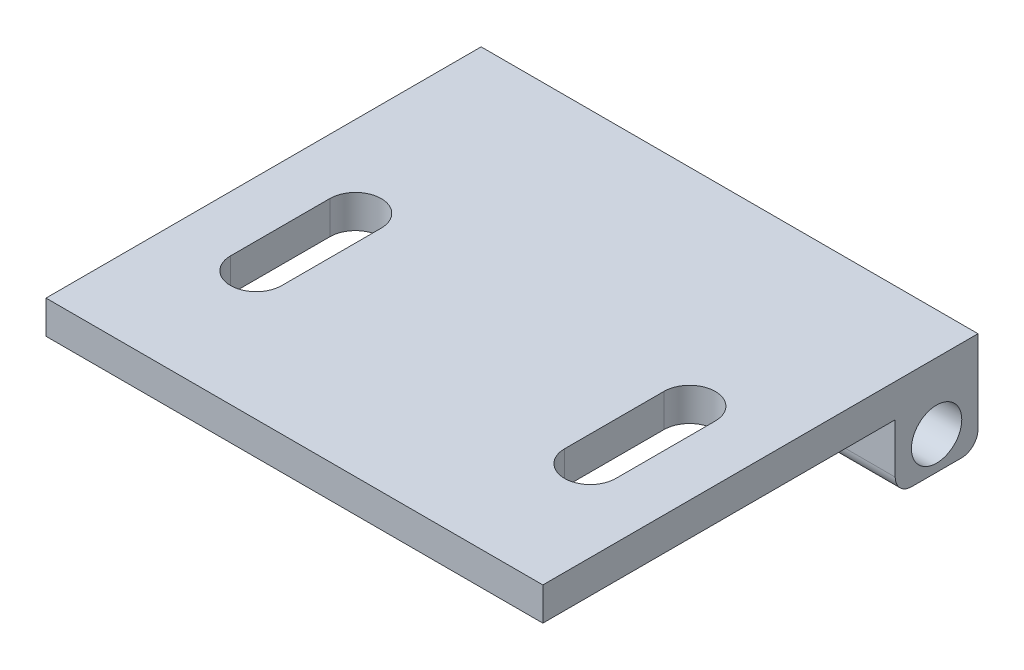
ISO-10303-21;
HEADER;
FILE_DESCRIPTION(('STEP AP214'),'2;1');
FILE_NAME('part.step','',(''),(''),'','','');
FILE_SCHEMA(('AUTOMOTIVE_DESIGN { 1 0 10303 214 1 1 1 1 }'));
ENDSEC;
DATA;
#1=APPLICATION_CONTEXT('core data for automotive mechanical design processes');
#2=APPLICATION_PROTOCOL_DEFINITION('international standard','automotive_design',2000,#1);
#3=PRODUCT_CONTEXT('',#1,'mechanical');
#4=PRODUCT('Part','Part','',(#3));
#5=PRODUCT_RELATED_PRODUCT_CATEGORY('part','',(#4));
#6=PRODUCT_DEFINITION_FORMATION('','',#4);
#7=PRODUCT_DEFINITION_CONTEXT('part definition',#1,'design');
#8=PRODUCT_DEFINITION('design','',#6,#7);
#9=PRODUCT_DEFINITION_SHAPE('','',#8);
#10=(LENGTH_UNIT() NAMED_UNIT(*) SI_UNIT(.MILLI.,.METRE.));
#11=(NAMED_UNIT(*) PLANE_ANGLE_UNIT() SI_UNIT($,.RADIAN.));
#12=(NAMED_UNIT(*) SI_UNIT($,.STERADIAN.) SOLID_ANGLE_UNIT());
#13=UNCERTAINTY_MEASURE_WITH_UNIT(LENGTH_MEASURE(1.E-05),#10,'distance_accuracy_value','');
#14=(GEOMETRIC_REPRESENTATION_CONTEXT(3) GLOBAL_UNCERTAINTY_ASSIGNED_CONTEXT((#13)) GLOBAL_UNIT_ASSIGNED_CONTEXT((#10,
#11,#12)) REPRESENTATION_CONTEXT('',''));
#15=CARTESIAN_POINT('',(0.,0.,0.));
#16=DIRECTION('',(0.,0.,1.));
#17=DIRECTION('',(1.,0.,0.));
#18=AXIS2_PLACEMENT_3D('',#15,#16,#17);
#19=CARTESIAN_POINT('',(30.,1.11113094634996,-10.7178759968555));
#20=DIRECTION('',(1.,0.,0.));
#21=DIRECTION('',(0.,0.,-1.));
#22=AXIS2_PLACEMENT_3D('',#19,#20,#21);
#23=PLANE('',#22);
#24=DIRECTION('',(0.,0.,1.));
#25=VECTOR('',#24,1.);
#26=CARTESIAN_POINT('',(30.,6.11113094634996,-14.2178759968555));
#27=LINE('',#26,#25);
#28=CARTESIAN_POINT('',(30.,6.11113094634996,-14.7178759968555));
#29=VERTEX_POINT('',#28);
#30=CARTESIAN_POINT('',(30.,6.11113094634996,11.5556113086594));
#31=VERTEX_POINT('',#30);
#32=EDGE_CURVE('E221',#29,#31,#27,.T.);
#33=ORIENTED_EDGE('',*,*,#32,.T.);
#34=DIRECTION('',(0.,-1.,0.));
#35=VECTOR('',#34,1.);
#36=CARTESIAN_POINT('',(30.,6.11113094634996,11.5556113086594));
#37=LINE('',#36,#35);
#38=CARTESIAN_POINT('',(30.,4.11113094634996,11.5556113086594));
#39=VERTEX_POINT('',#38);
#40=EDGE_CURVE('E224',#31,#39,#37,.T.);
#41=ORIENTED_EDGE('',*,*,#40,.T.);
#42=DIRECTION('',(0.,0.,-1.));
#43=VECTOR('',#42,1.);
#44=CARTESIAN_POINT('',(30.,4.11113094634996,11.5556113086594));
#45=LINE('',#44,#43);
#46=CARTESIAN_POINT('',(30.,4.11113094634996,-9.71787599685553));
#47=VERTEX_POINT('',#46);
#48=EDGE_CURVE('E227',#39,#47,#45,.T.);
#49=ORIENTED_EDGE('',*,*,#48,.T.);
#50=DIRECTION('',(0.,-1.,0.));
#51=VECTOR('',#50,1.);
#52=CARTESIAN_POINT('',(30.,4.11113094634996,-9.71787599685553));
#53=LINE('',#52,#51);
#54=CARTESIAN_POINT('',(30.,1.11113094634997,-9.71787599685553));
#55=VERTEX_POINT('',#54);
#56=EDGE_CURVE('E229',#47,#55,#53,.T.);
#57=ORIENTED_EDGE('',*,*,#56,.T.);
#58=CARTESIAN_POINT('',(30.,1.11113094634996,-10.7178759968555));
#59=DIRECTION('',(1.,0.,0.));
#60=DIRECTION('',(0.,0.,-1.));
#61=AXIS2_PLACEMENT_3D('',#58,#59,#60);
#62=CIRCLE('',#61,1.);
#63=CARTESIAN_POINT('',(30.,0.111130946349961,-10.7178759968555));
#64=VERTEX_POINT('',#63);
#65=EDGE_CURVE('E231',#55,#64,#62,.T.);
#66=ORIENTED_EDGE('',*,*,#65,.T.);
#67=DIRECTION('',(0.,0.,-1.));
#68=VECTOR('',#67,1.);
#69=CARTESIAN_POINT('',(30.,0.111130946349961,-13.7178759968555));
#70=LINE('',#69,#68);
#71=CARTESIAN_POINT('',(30.,0.111130946349961,-13.7178759968555));
#72=VERTEX_POINT('',#71);
#73=EDGE_CURVE('E233',#64,#72,#70,.T.);
#74=ORIENTED_EDGE('',*,*,#73,.T.);
#75=CARTESIAN_POINT('',(30.,1.11113094634996,-13.7178759968555));
#76=DIRECTION('',(1.,0.,0.));
#77=DIRECTION('',(0.,0.,1.));
#78=AXIS2_PLACEMENT_3D('',#75,#76,#77);
#79=CIRCLE('',#78,1.);
#80=CARTESIAN_POINT('',(30.,1.11113094634997,-14.7178759968555));
#81=VERTEX_POINT('',#80);
#82=EDGE_CURVE('E235',#72,#81,#79,.T.);
#83=ORIENTED_EDGE('',*,*,#82,.T.);
#84=DIRECTION('',(0.,1.,0.));
#85=VECTOR('',#84,1.);
#86=CARTESIAN_POINT('',(30.,1.11113094634997,-14.7178759968555));
#87=LINE('',#86,#85);
#88=EDGE_CURVE('E237',#81,#29,#87,.T.);
#89=ORIENTED_EDGE('',*,*,#88,.T.);
#90=EDGE_LOOP('',(#33,#41,#49,#57,#66,#74,#83,#89));
#91=FACE_BOUND('',#90,.T.);
#92=CARTESIAN_POINT('',(30.,2.11113094634996,-12.2178759968555));
#93=DIRECTION('',(1.,0.,0.));
#94=DIRECTION('',(0.,0.,-1.));
#95=AXIS2_PLACEMENT_3D('',#92,#93,#94);
#96=CIRCLE('',#95,1.52);
#97=CARTESIAN_POINT('',(30.,2.11113094634996,-13.7378759968555));
#98=VERTEX_POINT('',#97);
#99=EDGE_CURVE('E215',#98,#98,#96,.T.);
#100=ORIENTED_EDGE('',*,*,#99,.F.);
#101=EDGE_LOOP('',(#100));
#102=FACE_BOUND('',#101,.T.);
#103=ADVANCED_FACE('F32',(#91,#102),#23,.T.);
#104=CARTESIAN_POINT('',(0.,1.11113094634996,-10.7178759968555));
#105=DIRECTION('',(1.,0.,0.));
#106=DIRECTION('',(0.,0.,-1.));
#107=AXIS2_PLACEMENT_3D('',#104,#105,#106);
#108=PLANE('',#107);
#109=DIRECTION('',(0.,-1.,0.));
#110=VECTOR('',#109,1.);
#111=CARTESIAN_POINT('',(0.,6.11113094634996,11.5556113086594));
#112=LINE('',#111,#110);
#113=CARTESIAN_POINT('',(0.,6.11113094634996,11.5556113086594));
#114=VERTEX_POINT('',#113);
#115=CARTESIAN_POINT('',(0.,4.11113094634996,11.5556113086594));
#116=VERTEX_POINT('',#115);
#117=EDGE_CURVE('E218',#114,#116,#112,.T.);
#118=ORIENTED_EDGE('',*,*,#117,.F.);
#119=DIRECTION('',(0.,0.,1.));
#120=VECTOR('',#119,1.);
#121=CARTESIAN_POINT('',(0.,6.11113094634996,-14.2178759968555));
#122=LINE('',#121,#120);
#123=CARTESIAN_POINT('',(0.,6.11113094634996,-14.7178759968555));
#124=VERTEX_POINT('',#123);
#125=EDGE_CURVE('E225',#124,#114,#122,.T.);
#126=ORIENTED_EDGE('',*,*,#125,.F.);
#127=DIRECTION('',(0.,1.,0.));
#128=VECTOR('',#127,1.);
#129=CARTESIAN_POINT('',(0.,1.11113094634997,-14.7178759968555));
#130=LINE('',#129,#128);
#131=CARTESIAN_POINT('',(0.,1.11113094634997,-14.7178759968555));
#132=VERTEX_POINT('',#131);
#133=EDGE_CURVE('E252',#132,#124,#130,.T.);
#134=ORIENTED_EDGE('',*,*,#133,.F.);
#135=CARTESIAN_POINT('',(0.,1.11113094634996,-13.7178759968555));
#136=DIRECTION('',(1.,0.,0.));
#137=DIRECTION('',(0.,0.,1.));
#138=AXIS2_PLACEMENT_3D('',#135,#136,#137);
#139=CIRCLE('',#138,1.);
#140=CARTESIAN_POINT('',(0.,0.111130946349961,-13.7178759968555));
#141=VERTEX_POINT('',#140);
#142=EDGE_CURVE('E250',#141,#132,#139,.T.);
#143=ORIENTED_EDGE('',*,*,#142,.F.);
#144=DIRECTION('',(0.,0.,-1.));
#145=VECTOR('',#144,1.);
#146=CARTESIAN_POINT('',(0.,0.111130946349961,-13.7178759968555));
#147=LINE('',#146,#145);
#148=CARTESIAN_POINT('',(0.,0.111130946349961,-10.7178759968555));
#149=VERTEX_POINT('',#148);
#150=EDGE_CURVE('E248',#149,#141,#147,.T.);
#151=ORIENTED_EDGE('',*,*,#150,.F.);
#152=CARTESIAN_POINT('',(0.,1.11113094634996,-10.7178759968555));
#153=DIRECTION('',(1.,0.,0.));
#154=DIRECTION('',(0.,0.,-1.));
#155=AXIS2_PLACEMENT_3D('',#152,#153,#154);
#156=CIRCLE('',#155,1.);
#157=CARTESIAN_POINT('',(0.,1.11113094634997,-9.71787599685553));
#158=VERTEX_POINT('',#157);
#159=EDGE_CURVE('E246',#158,#149,#156,.T.);
#160=ORIENTED_EDGE('',*,*,#159,.F.);
#161=DIRECTION('',(0.,-1.,0.));
#162=VECTOR('',#161,1.);
#163=CARTESIAN_POINT('',(0.,4.11113094634996,-9.71787599685553));
#164=LINE('',#163,#162);
#165=CARTESIAN_POINT('',(0.,4.11113094634996,-9.71787599685553));
#166=VERTEX_POINT('',#165);
#167=EDGE_CURVE('E244',#166,#158,#164,.T.);
#168=ORIENTED_EDGE('',*,*,#167,.F.);
#169=DIRECTION('',(0.,0.,-1.));
#170=VECTOR('',#169,1.);
#171=CARTESIAN_POINT('',(0.,4.11113094634996,11.5556113086594));
#172=LINE('',#171,#170);
#173=EDGE_CURVE('E242',#116,#166,#172,.T.);
#174=ORIENTED_EDGE('',*,*,#173,.F.);
#175=EDGE_LOOP('',(#118,#126,#134,#143,#151,#160,#168,#174));
#176=FACE_BOUND('',#175,.T.);
#177=CARTESIAN_POINT('',(0.,2.11113094634996,-12.2178759968555));
#178=DIRECTION('',(1.,0.,0.));
#179=DIRECTION('',(0.,0.,-1.));
#180=AXIS2_PLACEMENT_3D('',#177,#178,#179);
#181=CIRCLE('',#180,1.52);
#182=CARTESIAN_POINT('',(0.,2.11113094634996,-13.7378759968555));
#183=VERTEX_POINT('',#182);
#184=EDGE_CURVE('E214',#183,#183,#181,.T.);
#185=ORIENTED_EDGE('',*,*,#184,.T.);
#186=EDGE_LOOP('',(#185));
#187=FACE_BOUND('',#186,.T.);
#188=ADVANCED_FACE('F282',(#176,#187),#108,.F.);
#189=CARTESIAN_POINT('',(30.,6.11113094634996,11.5556113086594));
#190=DIRECTION('',(0.,0.,-1.));
#191=DIRECTION('',(-1.,0.,0.));
#192=AXIS2_PLACEMENT_3D('',#189,#190,#191);
#193=PLANE('',#192);
#194=ORIENTED_EDGE('',*,*,#117,.T.);
#195=DIRECTION('',(-1.,0.,0.));
#196=VECTOR('',#195,1.);
#197=CARTESIAN_POINT('',(30.,4.11113094634996,11.5556113086594));
#198=LINE('',#197,#196);
#199=EDGE_CURVE('E40',#39,#116,#198,.T.);
#200=ORIENTED_EDGE('',*,*,#199,.F.);
#201=ORIENTED_EDGE('',*,*,#40,.F.);
#202=DIRECTION('',(-1.,0.,0.));
#203=VECTOR('',#202,1.);
#204=CARTESIAN_POINT('',(30.,6.11113094634996,11.5556113086594));
#205=LINE('',#204,#203);
#206=EDGE_CURVE('E11',#31,#114,#205,.T.);
#207=ORIENTED_EDGE('',*,*,#206,.T.);
#208=EDGE_LOOP('',(#194,#200,#201,#207));
#209=FACE_BOUND('',#208,.T.);
#210=ADVANCED_FACE('F34',(#209),#193,.F.);
#211=CARTESIAN_POINT('',(30.,4.11113094634996,11.5556113086594));
#212=DIRECTION('',(0.,1.,0.));
#213=DIRECTION('',(0.,0.,1.));
#214=AXIS2_PLACEMENT_3D('',#211,#212,#213);
#215=PLANE('',#214);
#216=DIRECTION('',(0.,0.,1.));
#217=VECTOR('',#216,1.);
#218=CARTESIAN_POINT('',(23.5356080863024,4.11113094634996,11.5556113086594));
#219=LINE('',#218,#217);
#220=CARTESIAN_POINT('',(23.5356080863024,4.11113094634996,-2.21787599693232));
#221=VERTEX_POINT('',#220);
#222=CARTESIAN_POINT('',(23.5356080863024,4.11113094634996,3.78212400306768));
#223=VERTEX_POINT('',#222);
#224=EDGE_CURVE('E176',#221,#223,#219,.T.);
#225=ORIENTED_EDGE('',*,*,#224,.T.);
#226=CARTESIAN_POINT('',(25.0856080863024,4.11113094634996,3.78212400306768));
#227=DIRECTION('',(0.,1.,0.));
#228=DIRECTION('',(0.,0.,1.));
#229=AXIS2_PLACEMENT_3D('',#226,#227,#228);
#230=CIRCLE('',#229,1.55);
#231=CARTESIAN_POINT('',(26.6356080863024,4.11113094634996,3.78212400306768));
#232=VERTEX_POINT('',#231);
#233=EDGE_CURVE('E179',#223,#232,#230,.T.);
#234=ORIENTED_EDGE('',*,*,#233,.T.);
#235=DIRECTION('',(0.,0.,-1.));
#236=VECTOR('',#235,1.);
#237=CARTESIAN_POINT('',(26.6356080863024,4.11113094634996,11.5556113086594));
#238=LINE('',#237,#236);
#239=CARTESIAN_POINT('',(26.6356080863024,4.11113094634996,-2.21787599693232));
#240=VERTEX_POINT('',#239);
#241=EDGE_CURVE('E171',#232,#240,#238,.T.);
#242=ORIENTED_EDGE('',*,*,#241,.T.);
#243=CARTESIAN_POINT('',(25.0856080863024,4.11113094634996,-2.21787599693232));
#244=DIRECTION('',(0.,1.,0.));
#245=DIRECTION('',(0.,0.,1.));
#246=AXIS2_PLACEMENT_3D('',#243,#244,#245);
#247=CIRCLE('',#246,1.55);
#248=EDGE_CURVE('E151',#240,#221,#247,.T.);
#249=ORIENTED_EDGE('',*,*,#248,.T.);
#250=EDGE_LOOP('',(#225,#234,#242,#249));
#251=FACE_BOUND('',#250,.T.);
#252=DIRECTION('',(0.,0.,1.));
#253=VECTOR('',#252,1.);
#254=CARTESIAN_POINT('',(3.36439191369755,4.11113094634996,11.5556113086594));
#255=LINE('',#254,#253);
#256=CARTESIAN_POINT('',(3.36439191369755,4.11113094634996,-2.21787599693232));
#257=VERTEX_POINT('',#256);
#258=CARTESIAN_POINT('',(3.36439191369755,4.11113094634996,3.78212400306768));
#259=VERTEX_POINT('',#258);
#260=EDGE_CURVE('E208',#257,#259,#255,.T.);
#261=ORIENTED_EDGE('',*,*,#260,.T.);
#262=CARTESIAN_POINT('',(4.91439191369755,4.11113094634996,3.78212400306768));
#263=DIRECTION('',(0.,1.,0.));
#264=DIRECTION('',(0.,0.,1.));
#265=AXIS2_PLACEMENT_3D('',#262,#263,#264);
#266=CIRCLE('',#265,1.55);
#267=CARTESIAN_POINT('',(6.46439191369755,4.11113094634996,3.78212400306768));
#268=VERTEX_POINT('',#267);
#269=EDGE_CURVE('E211',#259,#268,#266,.T.);
#270=ORIENTED_EDGE('',*,*,#269,.T.);
#271=DIRECTION('',(0.,0.,-1.));
#272=VECTOR('',#271,1.);
#273=CARTESIAN_POINT('',(6.46439191369755,4.11113094634996,11.5556113086594));
#274=LINE('',#273,#272);
#275=CARTESIAN_POINT('',(6.46439191369755,4.11113094634996,-2.21787599693232));
#276=VERTEX_POINT('',#275);
#277=EDGE_CURVE('E196',#268,#276,#274,.T.);
#278=ORIENTED_EDGE('',*,*,#277,.T.);
#279=CARTESIAN_POINT('',(4.91439191369755,4.11113094634996,-2.21787599693232));
#280=DIRECTION('',(0.,1.,0.));
#281=DIRECTION('',(0.,0.,1.));
#282=AXIS2_PLACEMENT_3D('',#279,#280,#281);
#283=CIRCLE('',#282,1.55);
#284=EDGE_CURVE('E205',#276,#257,#283,.T.);
#285=ORIENTED_EDGE('',*,*,#284,.T.);
#286=EDGE_LOOP('',(#261,#270,#278,#285));
#287=FACE_BOUND('',#286,.T.);
#288=ORIENTED_EDGE('',*,*,#173,.T.);
#289=DIRECTION('',(-1.,0.,0.));
#290=VECTOR('',#289,1.);
#291=CARTESIAN_POINT('',(30.,4.11113094634996,-9.71787599685553));
#292=LINE('',#291,#290);
#293=EDGE_CURVE('E269',#47,#166,#292,.T.);
#294=ORIENTED_EDGE('',*,*,#293,.F.);
#295=ORIENTED_EDGE('',*,*,#48,.F.);
#296=ORIENTED_EDGE('',*,*,#199,.T.);
#297=EDGE_LOOP('',(#288,#294,#295,#296));
#298=FACE_BOUND('',#297,.T.);
#299=ADVANCED_FACE('F276',(#251,#287,#298),#215,.F.);
#300=CARTESIAN_POINT('',(30.,4.11113094634996,-9.71787599685553));
#301=DIRECTION('',(0.,0.,-1.));
#302=DIRECTION('',(-1.,0.,0.));
#303=AXIS2_PLACEMENT_3D('',#300,#301,#302);
#304=PLANE('',#303);
#305=ORIENTED_EDGE('',*,*,#167,.T.);
#306=DIRECTION('',(-1.,0.,0.));
#307=VECTOR('',#306,1.);
#308=CARTESIAN_POINT('',(30.,1.11113094634997,-9.71787599685553));
#309=LINE('',#308,#307);
#310=EDGE_CURVE('E266',#55,#158,#309,.T.);
#311=ORIENTED_EDGE('',*,*,#310,.F.);
#312=ORIENTED_EDGE('',*,*,#56,.F.);
#313=ORIENTED_EDGE('',*,*,#293,.T.);
#314=EDGE_LOOP('',(#305,#311,#312,#313));
#315=FACE_BOUND('',#314,.T.);
#316=ADVANCED_FACE('F289',(#315),#304,.F.);
#317=CARTESIAN_POINT('',(30.,1.11113094634996,-10.7178759968555));
#318=DIRECTION('',(-1.,0.,0.));
#319=DIRECTION('',(0.,0.,1.));
#320=AXIS2_PLACEMENT_3D('',#317,#318,#319);
#321=CYLINDRICAL_SURFACE('',#320,1.);
#322=ORIENTED_EDGE('',*,*,#159,.T.);
#323=DIRECTION('',(-1.,0.,0.));
#324=VECTOR('',#323,1.);
#325=CARTESIAN_POINT('',(30.,0.111130946349961,-10.7178759968555));
#326=LINE('',#325,#324);
#327=EDGE_CURVE('E263',#64,#149,#326,.T.);
#328=ORIENTED_EDGE('',*,*,#327,.F.);
#329=ORIENTED_EDGE('',*,*,#65,.F.);
#330=ORIENTED_EDGE('',*,*,#310,.T.);
#331=EDGE_LOOP('',(#322,#328,#329,#330));
#332=FACE_BOUND('',#331,.T.);
#333=ADVANCED_FACE('F293',(#332),#321,.T.);
#334=CARTESIAN_POINT('',(30.,0.111130946349961,-13.7178759968555));
#335=DIRECTION('',(0.,1.,0.));
#336=DIRECTION('',(0.,0.,1.));
#337=AXIS2_PLACEMENT_3D('',#334,#335,#336);
#338=PLANE('',#337);
#339=ORIENTED_EDGE('',*,*,#150,.T.);
#340=DIRECTION('',(-1.,0.,0.));
#341=VECTOR('',#340,1.);
#342=CARTESIAN_POINT('',(30.,0.111130946349961,-13.7178759968555));
#343=LINE('',#342,#341);
#344=EDGE_CURVE('E260',#72,#141,#343,.T.);
#345=ORIENTED_EDGE('',*,*,#344,.F.);
#346=ORIENTED_EDGE('',*,*,#73,.F.);
#347=ORIENTED_EDGE('',*,*,#327,.T.);
#348=EDGE_LOOP('',(#339,#345,#346,#347));
#349=FACE_BOUND('',#348,.T.);
#350=ADVANCED_FACE('F312',(#349),#338,.F.);
#351=CARTESIAN_POINT('',(30.,1.11113094634996,-13.7178759968555));
#352=DIRECTION('',(-1.,0.,0.));
#353=DIRECTION('',(0.,0.,1.));
#354=AXIS2_PLACEMENT_3D('',#351,#352,#353);
#355=CYLINDRICAL_SURFACE('',#354,1.);
#356=ORIENTED_EDGE('',*,*,#142,.T.);
#357=DIRECTION('',(-1.,0.,0.));
#358=VECTOR('',#357,1.);
#359=CARTESIAN_POINT('',(30.,1.11113094634997,-14.7178759968555));
#360=LINE('',#359,#358);
#361=EDGE_CURVE('E257',#81,#132,#360,.T.);
#362=ORIENTED_EDGE('',*,*,#361,.F.);
#363=ORIENTED_EDGE('',*,*,#82,.F.);
#364=ORIENTED_EDGE('',*,*,#344,.T.);
#365=EDGE_LOOP('',(#356,#362,#363,#364));
#366=FACE_BOUND('',#365,.T.);
#367=ADVANCED_FACE('F310',(#366),#355,.T.);
#368=CARTESIAN_POINT('',(30.,1.11113094634997,-14.7178759968555));
#369=DIRECTION('',(0.,0.,1.));
#370=DIRECTION('',(1.,0.,0.));
#371=AXIS2_PLACEMENT_3D('',#368,#369,#370);
#372=PLANE('',#371);
#373=ORIENTED_EDGE('',*,*,#133,.T.);
#374=DIRECTION('',(-1.,0.,0.));
#375=VECTOR('',#374,1.);
#376=CARTESIAN_POINT('',(30.,6.11113094634996,-14.7178759968555));
#377=LINE('',#376,#375);
#378=EDGE_CURVE('E240',#29,#124,#377,.T.);
#379=ORIENTED_EDGE('',*,*,#378,.F.);
#380=ORIENTED_EDGE('',*,*,#88,.F.);
#381=ORIENTED_EDGE('',*,*,#361,.T.);
#382=EDGE_LOOP('',(#373,#379,#380,#381));
#383=FACE_BOUND('',#382,.T.);
#384=ADVANCED_FACE('F305',(#383),#372,.F.);
#385=CARTESIAN_POINT('',(30.,6.11113094634996,-14.2178759968555));
#386=DIRECTION('',(0.,-1.,0.));
#387=DIRECTION('',(0.,0.,-1.));
#388=AXIS2_PLACEMENT_3D('',#385,#386,#387);
#389=PLANE('',#388);
#390=DIRECTION('',(0.,0.,-1.));
#391=VECTOR('',#390,1.);
#392=CARTESIAN_POINT('',(26.6356080863024,6.11113094634996,3.78212400306768));
#393=LINE('',#392,#391);
#394=CARTESIAN_POINT('',(26.6356080863024,6.11113094634996,3.78212400306768));
#395=VERTEX_POINT('',#394);
#396=CARTESIAN_POINT('',(26.6356080863024,6.11113094634996,-2.21787599693232));
#397=VERTEX_POINT('',#396);
#398=EDGE_CURVE('E157',#395,#397,#393,.T.);
#399=ORIENTED_EDGE('',*,*,#398,.F.);
#400=CARTESIAN_POINT('',(25.0856080863024,6.11113094634996,3.78212400306768));
#401=DIRECTION('',(0.,1.,0.));
#402=DIRECTION('',(0.,0.,-1.));
#403=AXIS2_PLACEMENT_3D('',#400,#401,#402);
#404=CIRCLE('',#403,1.55);
#405=CARTESIAN_POINT('',(23.5356080863024,6.11113094634996,3.78212400306768));
#406=VERTEX_POINT('',#405);
#407=EDGE_CURVE('E55',#406,#395,#404,.T.);
#408=ORIENTED_EDGE('',*,*,#407,.F.);
#409=DIRECTION('',(0.,0.,1.));
#410=VECTOR('',#409,1.);
#411=CARTESIAN_POINT('',(23.5356080863024,6.11113094634996,3.78212400306768));
#412=LINE('',#411,#410);
#413=CARTESIAN_POINT('',(23.5356080863024,6.11113094634996,-2.21787599693232));
#414=VERTEX_POINT('',#413);
#415=EDGE_CURVE('E164',#414,#406,#412,.T.);
#416=ORIENTED_EDGE('',*,*,#415,.F.);
#417=CARTESIAN_POINT('',(25.0856080863024,6.11113094634996,-2.21787599693232));
#418=DIRECTION('',(0.,1.,0.));
#419=DIRECTION('',(0.,0.,-1.));
#420=AXIS2_PLACEMENT_3D('',#417,#418,#419);
#421=CIRCLE('',#420,1.55);
#422=EDGE_CURVE('E148',#397,#414,#421,.T.);
#423=ORIENTED_EDGE('',*,*,#422,.F.);
#424=EDGE_LOOP('',(#399,#408,#416,#423));
#425=FACE_BOUND('',#424,.T.);
#426=DIRECTION('',(0.,0.,-1.));
#427=VECTOR('',#426,1.);
#428=CARTESIAN_POINT('',(6.46439191369755,6.11113094634996,3.78212400306768));
#429=LINE('',#428,#427);
#430=CARTESIAN_POINT('',(6.46439191369755,6.11113094634996,3.78212400306768));
#431=VERTEX_POINT('',#430);
#432=CARTESIAN_POINT('',(6.46439191369755,6.11113094634996,-2.21787599693232));
#433=VERTEX_POINT('',#432);
#434=EDGE_CURVE('E184',#431,#433,#429,.T.);
#435=ORIENTED_EDGE('',*,*,#434,.F.);
#436=CARTESIAN_POINT('',(4.91439191369755,6.11113094634996,3.78212400306768));
#437=DIRECTION('',(0.,1.,0.));
#438=DIRECTION('',(0.,0.,1.));
#439=AXIS2_PLACEMENT_3D('',#436,#437,#438);
#440=CIRCLE('',#439,1.55);
#441=CARTESIAN_POINT('',(3.36439191369755,6.11113094634996,3.78212400306768));
#442=VERTEX_POINT('',#441);
#443=EDGE_CURVE('E182',#442,#431,#440,.T.);
#444=ORIENTED_EDGE('',*,*,#443,.F.);
#445=DIRECTION('',(0.,0.,1.));
#446=VECTOR('',#445,1.);
#447=CARTESIAN_POINT('',(3.36439191369755,6.11113094634996,3.78212400306768));
#448=LINE('',#447,#446);
#449=CARTESIAN_POINT('',(3.36439191369755,6.11113094634996,-2.21787599693232));
#450=VERTEX_POINT('',#449);
#451=EDGE_CURVE('E190',#450,#442,#448,.T.);
#452=ORIENTED_EDGE('',*,*,#451,.F.);
#453=CARTESIAN_POINT('',(4.91439191369755,6.11113094634996,-2.21787599693232));
#454=DIRECTION('',(0.,1.,0.));
#455=DIRECTION('',(0.,0.,1.));
#456=AXIS2_PLACEMENT_3D('',#453,#454,#455);
#457=CIRCLE('',#456,1.55);
#458=EDGE_CURVE('E187',#433,#450,#457,.T.);
#459=ORIENTED_EDGE('',*,*,#458,.F.);
#460=EDGE_LOOP('',(#435,#444,#452,#459));
#461=FACE_BOUND('',#460,.T.);
#462=ORIENTED_EDGE('',*,*,#125,.T.);
#463=ORIENTED_EDGE('',*,*,#206,.F.);
#464=ORIENTED_EDGE('',*,*,#32,.F.);
#465=ORIENTED_EDGE('',*,*,#378,.T.);
#466=EDGE_LOOP('',(#462,#463,#464,#465));
#467=FACE_BOUND('',#466,.T.);
#468=ADVANCED_FACE('F161',(#425,#461,#467),#389,.F.);
#469=CARTESIAN_POINT('',(30.,2.11113094634996,-12.2178759968555));
#470=DIRECTION('',(-1.,0.,0.));
#471=DIRECTION('',(0.,0.,1.));
#472=AXIS2_PLACEMENT_3D('',#469,#470,#471);
#473=CYLINDRICAL_SURFACE('',#472,1.52);
#474=ORIENTED_EDGE('',*,*,#99,.T.);
#475=EDGE_LOOP('',(#474));
#476=FACE_BOUND('',#475,.T.);
#477=ORIENTED_EDGE('',*,*,#184,.F.);
#478=EDGE_LOOP('',(#477));
#479=FACE_BOUND('',#478,.T.);
#480=ADVANCED_FACE('F328',(#476,#479),#473,.F.);
#481=CARTESIAN_POINT('',(4.91439191369755,-3.88886905365004,3.78212400306768));
#482=DIRECTION('',(0.,1.,0.));
#483=DIRECTION('',(0.,0.,1.));
#484=AXIS2_PLACEMENT_3D('',#481,#482,#483);
#485=CYLINDRICAL_SURFACE('',#484,1.55);
#486=DIRECTION('',(0.,1.,0.));
#487=VECTOR('',#486,1.);
#488=CARTESIAN_POINT('',(3.36439191369755,-3.88886905365004,3.78212400306768));
#489=LINE('',#488,#487);
#490=EDGE_CURVE('E194',#259,#442,#489,.T.);
#491=ORIENTED_EDGE('',*,*,#490,.T.);
#492=ORIENTED_EDGE('',*,*,#443,.T.);
#493=DIRECTION('',(0.,1.,0.));
#494=VECTOR('',#493,1.);
#495=CARTESIAN_POINT('',(6.46439191369755,-3.88886905365004,3.78212400306768));
#496=LINE('',#495,#494);
#497=EDGE_CURVE('E193',#268,#431,#496,.T.);
#498=ORIENTED_EDGE('',*,*,#497,.F.);
#499=ORIENTED_EDGE('',*,*,#269,.F.);
#500=EDGE_LOOP('',(#491,#492,#498,#499));
#501=FACE_BOUND('',#500,.T.);
#502=ADVANCED_FACE('F350',(#501),#485,.F.);
#503=CARTESIAN_POINT('',(3.36439191369755,-3.88886905365004,3.78212400306768));
#504=DIRECTION('',(-1.,0.,0.));
#505=DIRECTION('',(0.,0.,1.));
#506=AXIS2_PLACEMENT_3D('',#503,#504,#505);
#507=PLANE('',#506);
#508=DIRECTION('',(0.,1.,0.));
#509=VECTOR('',#508,1.);
#510=CARTESIAN_POINT('',(3.36439191369755,-3.88886905365004,-2.21787599693232));
#511=LINE('',#510,#509);
#512=EDGE_CURVE('E197',#257,#450,#511,.T.);
#513=ORIENTED_EDGE('',*,*,#512,.T.);
#514=ORIENTED_EDGE('',*,*,#451,.T.);
#515=ORIENTED_EDGE('',*,*,#490,.F.);
#516=ORIENTED_EDGE('',*,*,#260,.F.);
#517=EDGE_LOOP('',(#513,#514,#515,#516));
#518=FACE_BOUND('',#517,.T.);
#519=ADVANCED_FACE('F356',(#518),#507,.F.);
#520=CARTESIAN_POINT('',(4.91439191369755,-3.88886905365004,-2.21787599693232));
#521=DIRECTION('',(0.,1.,0.));
#522=DIRECTION('',(0.,0.,1.));
#523=AXIS2_PLACEMENT_3D('',#520,#521,#522);
#524=CYLINDRICAL_SURFACE('',#523,1.55);
#525=DIRECTION('',(0.,1.,0.));
#526=VECTOR('',#525,1.);
#527=CARTESIAN_POINT('',(6.46439191369755,-3.88886905365004,-2.21787599693232));
#528=LINE('',#527,#526);
#529=EDGE_CURVE('E199',#276,#433,#528,.T.);
#530=ORIENTED_EDGE('',*,*,#529,.T.);
#531=ORIENTED_EDGE('',*,*,#458,.T.);
#532=ORIENTED_EDGE('',*,*,#512,.F.);
#533=ORIENTED_EDGE('',*,*,#284,.F.);
#534=EDGE_LOOP('',(#530,#531,#532,#533));
#535=FACE_BOUND('',#534,.T.);
#536=ADVANCED_FACE('F363',(#535),#524,.F.);
#537=CARTESIAN_POINT('',(6.46439191369755,-3.88886905365004,3.78212400306768));
#538=DIRECTION('',(1.,0.,0.));
#539=DIRECTION('',(0.,0.,-1.));
#540=AXIS2_PLACEMENT_3D('',#537,#538,#539);
#541=PLANE('',#540);
#542=ORIENTED_EDGE('',*,*,#497,.T.);
#543=ORIENTED_EDGE('',*,*,#434,.T.);
#544=ORIENTED_EDGE('',*,*,#529,.F.);
#545=ORIENTED_EDGE('',*,*,#277,.F.);
#546=EDGE_LOOP('',(#542,#543,#544,#545));
#547=FACE_BOUND('',#546,.T.);
#548=ADVANCED_FACE('F371',(#547),#541,.F.);
#549=CARTESIAN_POINT('',(25.0856080863024,-3.88886905365004,3.78212400306768));
#550=DIRECTION('',(0.,1.,0.));
#551=DIRECTION('',(0.,0.,1.));
#552=AXIS2_PLACEMENT_3D('',#549,#550,#551);
#553=CYLINDRICAL_SURFACE('',#552,1.55);
#554=DIRECTION('',(0.,1.,0.));
#555=VECTOR('',#554,1.);
#556=CARTESIAN_POINT('',(23.5356080863024,-3.88886905365004,3.78212400306768));
#557=LINE('',#556,#555);
#558=EDGE_CURVE('E169',#223,#406,#557,.T.);
#559=ORIENTED_EDGE('',*,*,#558,.T.);
#560=ORIENTED_EDGE('',*,*,#407,.T.);
#561=DIRECTION('',(0.,1.,0.));
#562=VECTOR('',#561,1.);
#563=CARTESIAN_POINT('',(26.6356080863024,-3.88886905365004,3.78212400306768));
#564=LINE('',#563,#562);
#565=EDGE_CURVE('E154',#232,#395,#564,.T.);
#566=ORIENTED_EDGE('',*,*,#565,.F.);
#567=ORIENTED_EDGE('',*,*,#233,.F.);
#568=EDGE_LOOP('',(#559,#560,#566,#567));
#569=FACE_BOUND('',#568,.T.);
#570=ADVANCED_FACE('F379',(#569),#553,.F.);
#571=CARTESIAN_POINT('',(23.5356080863024,-3.88886905365004,3.78212400306768));
#572=DIRECTION('',(-1.,0.,0.));
#573=DIRECTION('',(0.,0.,1.));
#574=AXIS2_PLACEMENT_3D('',#571,#572,#573);
#575=PLANE('',#574);
#576=DIRECTION('',(0.,1.,0.));
#577=VECTOR('',#576,1.);
#578=CARTESIAN_POINT('',(23.5356080863024,-3.88886905365004,-2.21787599693232));
#579=LINE('',#578,#577);
#580=EDGE_CURVE('E153',#221,#414,#579,.T.);
#581=ORIENTED_EDGE('',*,*,#580,.T.);
#582=ORIENTED_EDGE('',*,*,#415,.T.);
#583=ORIENTED_EDGE('',*,*,#558,.F.);
#584=ORIENTED_EDGE('',*,*,#224,.F.);
#585=EDGE_LOOP('',(#581,#582,#583,#584));
#586=FACE_BOUND('',#585,.T.);
#587=ADVANCED_FACE('F387',(#586),#575,.F.);
#588=CARTESIAN_POINT('',(25.0856080863024,-3.88886905365004,-2.21787599693232));
#589=DIRECTION('',(0.,1.,0.));
#590=DIRECTION('',(0.,0.,1.));
#591=AXIS2_PLACEMENT_3D('',#588,#589,#590);
#592=CYLINDRICAL_SURFACE('',#591,1.55);
#593=DIRECTION('',(0.,1.,0.));
#594=VECTOR('',#593,1.);
#595=CARTESIAN_POINT('',(26.6356080863024,-3.88886905365004,-2.21787599693232));
#596=LINE('',#595,#594);
#597=EDGE_CURVE('E47',#240,#397,#596,.T.);
#598=ORIENTED_EDGE('',*,*,#597,.T.);
#599=ORIENTED_EDGE('',*,*,#422,.T.);
#600=ORIENTED_EDGE('',*,*,#580,.F.);
#601=ORIENTED_EDGE('',*,*,#248,.F.);
#602=EDGE_LOOP('',(#598,#599,#600,#601));
#603=FACE_BOUND('',#602,.T.);
#604=ADVANCED_FACE('F145',(#603),#592,.F.);
#605=CARTESIAN_POINT('',(26.6356080863024,-3.88886905365004,3.78212400306768));
#606=DIRECTION('',(1.,0.,0.));
#607=DIRECTION('',(0.,0.,-1.));
#608=AXIS2_PLACEMENT_3D('',#605,#606,#607);
#609=PLANE('',#608);
#610=ORIENTED_EDGE('',*,*,#565,.T.);
#611=ORIENTED_EDGE('',*,*,#398,.T.);
#612=ORIENTED_EDGE('',*,*,#597,.F.);
#613=ORIENTED_EDGE('',*,*,#241,.F.);
#614=EDGE_LOOP('',(#610,#611,#612,#613));
#615=FACE_BOUND('',#614,.T.);
#616=ADVANCED_FACE('F158',(#615),#609,.F.);
#617=CLOSED_SHELL('',(#103,#188,#210,#299,#316,#333,#350,#367,#384,#468,#480,#502,#519,#536,
#548,#570,#587,#604,#616));
#618=MANIFOLD_SOLID_BREP('B2',#617);
#619=ADVANCED_BREP_SHAPE_REPRESENTATION('',(#18,#618),#14);
#620=SHAPE_DEFINITION_REPRESENTATION(#9,#619);
ENDSEC;
END-ISO-10303-21;
